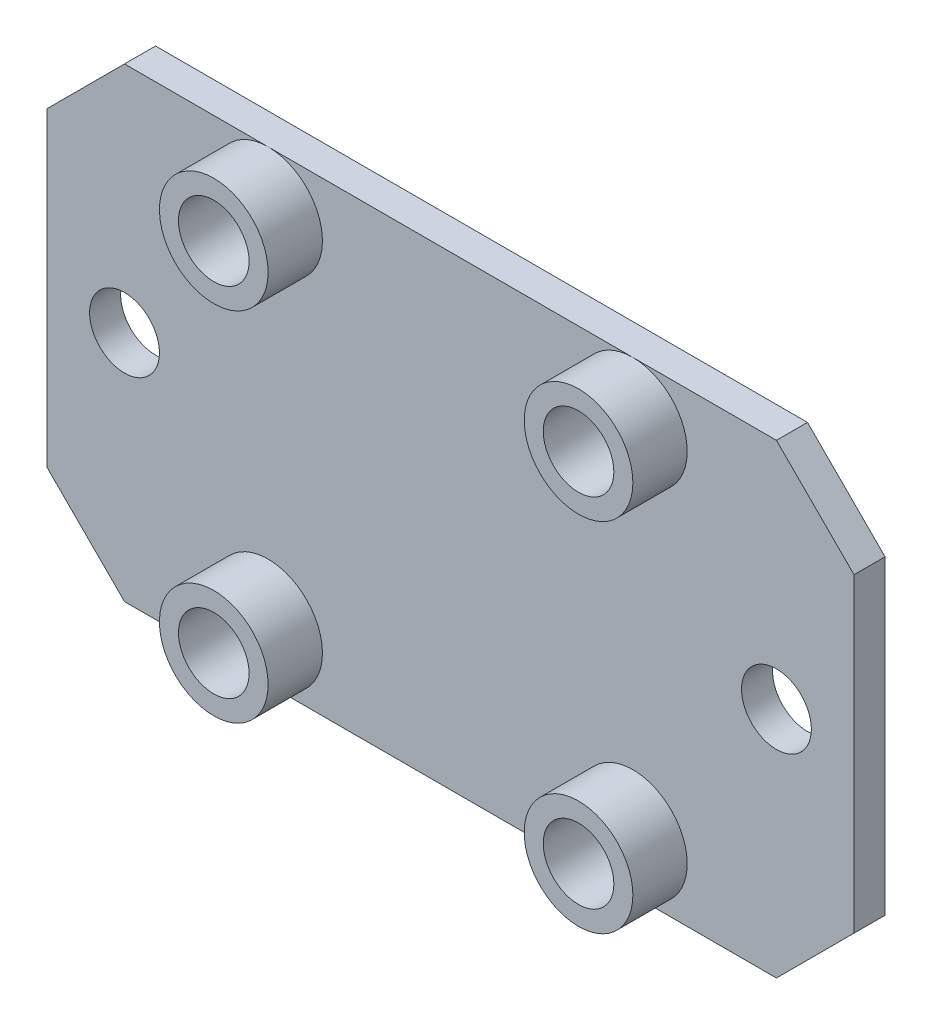
ISO-10303-21;
HEADER;
FILE_DESCRIPTION(('STEP AP214'),'2;1');
FILE_NAME('part.step','',(''),(''),'','','');
FILE_SCHEMA(('AUTOMOTIVE_DESIGN { 1 0 10303 214 1 1 1 1 }'));
ENDSEC;
DATA;
#1=APPLICATION_CONTEXT('core data for automotive mechanical design processes');
#2=APPLICATION_PROTOCOL_DEFINITION('international standard','automotive_design',2000,#1);
#3=PRODUCT_CONTEXT('',#1,'mechanical');
#4=PRODUCT('Part','Part','',(#3));
#5=PRODUCT_RELATED_PRODUCT_CATEGORY('part','',(#4));
#6=PRODUCT_DEFINITION_FORMATION('','',#4);
#7=PRODUCT_DEFINITION_CONTEXT('part definition',#1,'design');
#8=PRODUCT_DEFINITION('design','',#6,#7);
#9=PRODUCT_DEFINITION_SHAPE('','',#8);
#10=(LENGTH_UNIT() NAMED_UNIT(*) SI_UNIT(.MILLI.,.METRE.));
#11=(NAMED_UNIT(*) PLANE_ANGLE_UNIT() SI_UNIT($,.RADIAN.));
#12=(NAMED_UNIT(*) SI_UNIT($,.STERADIAN.) SOLID_ANGLE_UNIT());
#13=UNCERTAINTY_MEASURE_WITH_UNIT(LENGTH_MEASURE(1.E-05),#10,'distance_accuracy_value','');
#14=(GEOMETRIC_REPRESENTATION_CONTEXT(3) GLOBAL_UNCERTAINTY_ASSIGNED_CONTEXT((#13)) GLOBAL_UNIT_ASSIGNED_CONTEXT((#10,
#11,#12)) REPRESENTATION_CONTEXT('',''));
#15=CARTESIAN_POINT('',(0.,0.,0.));
#16=DIRECTION('',(0.,0.,1.));
#17=DIRECTION('',(1.,0.,0.));
#18=AXIS2_PLACEMENT_3D('',#15,#16,#17);
#19=CARTESIAN_POINT('',(0.,0.,2.));
#20=DIRECTION('',(0.,1.,0.));
#21=DIRECTION('',(0.,0.,1.));
#22=AXIS2_PLACEMENT_3D('',#19,#20,#21);
#23=PLANE('',#22);
#24=DIRECTION('',(1.,0.,0.));
#25=VECTOR('',#24,1.);
#26=CARTESIAN_POINT('',(0.,0.,2.));
#27=LINE('',#26,#25);
#28=CARTESIAN_POINT('',(-47.,0.,2.));
#29=VERTEX_POINT('',#28);
#30=CARTESIAN_POINT('',(-37.75,0.,2.));
#31=VERTEX_POINT('',#30);
#32=EDGE_CURVE('E136',#29,#31,#27,.T.);
#33=ORIENTED_EDGE('',*,*,#32,.F.);
#34=DIRECTION('',(0.,0.,-1.));
#35=VECTOR('',#34,1.);
#36=CARTESIAN_POINT('',(-47.,0.,2.));
#37=LINE('',#36,#35);
#38=CARTESIAN_POINT('',(-47.,0.,0.));
#39=VERTEX_POINT('',#38);
#40=EDGE_CURVE('E143',#29,#39,#37,.T.);
#41=ORIENTED_EDGE('',*,*,#40,.T.);
#42=DIRECTION('',(1.,0.,0.));
#43=VECTOR('',#42,1.);
#44=CARTESIAN_POINT('',(0.,0.,0.));
#45=LINE('',#44,#43);
#46=CARTESIAN_POINT('',(-5.00000000000002,0.,0.));
#47=VERTEX_POINT('',#46);
#48=EDGE_CURVE('E146',#39,#47,#45,.T.);
#49=ORIENTED_EDGE('',*,*,#48,.T.);
#50=DIRECTION('',(0.,0.,1.));
#51=VECTOR('',#50,1.);
#52=CARTESIAN_POINT('',(-5.00000000000002,0.,2.));
#53=LINE('',#52,#51);
#54=CARTESIAN_POINT('',(-5.00000000000002,0.,2.));
#55=VERTEX_POINT('',#54);
#56=EDGE_CURVE('E140',#47,#55,#53,.T.);
#57=ORIENTED_EDGE('',*,*,#56,.T.);
#58=CARTESIAN_POINT('',(-14.25,0.,2.));
#59=VERTEX_POINT('',#58);
#60=EDGE_CURVE('E157',#59,#55,#27,.T.);
#61=ORIENTED_EDGE('',*,*,#60,.F.);
#62=EDGE_CURVE('E214',#31,#59,#27,.T.);
#63=ORIENTED_EDGE('',*,*,#62,.F.);
#64=EDGE_LOOP('',(#33,#41,#49,#57,#61,#63));
#65=FACE_BOUND('',#64,.T.);
#66=ADVANCED_FACE('F43',(#65),#23,.F.);
#67=CARTESIAN_POINT('',(0.,0.,2.));
#68=DIRECTION('',(-1.,0.,0.));
#69=DIRECTION('',(0.,0.,1.));
#70=AXIS2_PLACEMENT_3D('',#67,#68,#69);
#71=PLANE('',#70);
#72=DIRECTION('',(0.,1.,0.));
#73=VECTOR('',#72,1.);
#74=CARTESIAN_POINT('',(0.,0.,2.));
#75=LINE('',#74,#73);
#76=CARTESIAN_POINT('',(0.,5.,2.));
#77=VERTEX_POINT('',#76);
#78=CARTESIAN_POINT('',(0.,25.,2.));
#79=VERTEX_POINT('',#78);
#80=EDGE_CURVE('E135',#77,#79,#75,.T.);
#81=ORIENTED_EDGE('',*,*,#80,.F.);
#82=DIRECTION('',(0.,0.,-1.));
#83=VECTOR('',#82,1.);
#84=CARTESIAN_POINT('',(0.,5.,2.));
#85=LINE('',#84,#83);
#86=CARTESIAN_POINT('',(0.,5.,0.));
#87=VERTEX_POINT('',#86);
#88=EDGE_CURVE('E183',#77,#87,#85,.T.);
#89=ORIENTED_EDGE('',*,*,#88,.T.);
#90=DIRECTION('',(0.,1.,0.));
#91=VECTOR('',#90,1.);
#92=CARTESIAN_POINT('',(0.,0.,0.));
#93=LINE('',#92,#91);
#94=CARTESIAN_POINT('',(0.,25.,0.));
#95=VERTEX_POINT('',#94);
#96=EDGE_CURVE('E149',#87,#95,#93,.T.);
#97=ORIENTED_EDGE('',*,*,#96,.T.);
#98=DIRECTION('',(0.,0.,1.));
#99=VECTOR('',#98,1.);
#100=CARTESIAN_POINT('',(0.,25.,2.));
#101=LINE('',#100,#99);
#102=EDGE_CURVE('E181',#95,#79,#101,.T.);
#103=ORIENTED_EDGE('',*,*,#102,.T.);
#104=EDGE_LOOP('',(#81,#89,#97,#103));
#105=FACE_BOUND('',#104,.T.);
#106=ADVANCED_FACE('F189',(#105),#71,.F.);
#107=CARTESIAN_POINT('',(0.,30.,2.));
#108=DIRECTION('',(0.,-1.,0.));
#109=DIRECTION('',(1.,0.,0.));
#110=AXIS2_PLACEMENT_3D('',#107,#108,#109);
#111=PLANE('',#110);
#112=DIRECTION('',(-1.,0.,0.));
#113=VECTOR('',#112,1.);
#114=CARTESIAN_POINT('',(0.,30.,2.));
#115=LINE('',#114,#113);
#116=CARTESIAN_POINT('',(-5.00000000000001,30.,2.));
#117=VERTEX_POINT('',#116);
#118=CARTESIAN_POINT('',(-14.25,30.,2.));
#119=VERTEX_POINT('',#118);
#120=EDGE_CURVE('E130',#117,#119,#115,.T.);
#121=ORIENTED_EDGE('',*,*,#120,.F.);
#122=DIRECTION('',(0.,0.,-1.));
#123=VECTOR('',#122,1.);
#124=CARTESIAN_POINT('',(-5.00000000000001,30.,2.));
#125=LINE('',#124,#123);
#126=CARTESIAN_POINT('',(-5.00000000000001,30.,0.));
#127=VERTEX_POINT('',#126);
#128=EDGE_CURVE('E11',#117,#127,#125,.T.);
#129=ORIENTED_EDGE('',*,*,#128,.T.);
#130=DIRECTION('',(-1.,0.,0.));
#131=VECTOR('',#130,1.);
#132=CARTESIAN_POINT('',(0.,30.,0.));
#133=LINE('',#132,#131);
#134=CARTESIAN_POINT('',(-47.,30.,0.));
#135=VERTEX_POINT('',#134);
#136=EDGE_CURVE('E153',#127,#135,#133,.T.);
#137=ORIENTED_EDGE('',*,*,#136,.T.);
#138=DIRECTION('',(0.,0.,1.));
#139=VECTOR('',#138,1.);
#140=CARTESIAN_POINT('',(-47.,30.,2.));
#141=LINE('',#140,#139);
#142=CARTESIAN_POINT('',(-47.,30.,2.));
#143=VERTEX_POINT('',#142);
#144=EDGE_CURVE('E52',#135,#143,#141,.T.);
#145=ORIENTED_EDGE('',*,*,#144,.T.);
#146=CARTESIAN_POINT('',(-37.75,30.,2.));
#147=VERTEX_POINT('',#146);
#148=EDGE_CURVE('E131',#147,#143,#115,.T.);
#149=ORIENTED_EDGE('',*,*,#148,.F.);
#150=EDGE_CURVE('E123',#119,#147,#115,.T.);
#151=ORIENTED_EDGE('',*,*,#150,.F.);
#152=EDGE_LOOP('',(#121,#129,#137,#145,#149,#151));
#153=FACE_BOUND('',#152,.T.);
#154=ADVANCED_FACE('F133',(#153),#111,.F.);
#155=CARTESIAN_POINT('',(-52.,0.,2.));
#156=DIRECTION('',(1.,0.,0.));
#157=DIRECTION('',(0.,0.,-1.));
#158=AXIS2_PLACEMENT_3D('',#155,#156,#157);
#159=PLANE('',#158);
#160=DIRECTION('',(0.,-1.,0.));
#161=VECTOR('',#160,1.);
#162=CARTESIAN_POINT('',(-52.,0.,0.));
#163=LINE('',#162,#161);
#164=CARTESIAN_POINT('',(-52.,25.,0.));
#165=VERTEX_POINT('',#164);
#166=CARTESIAN_POINT('',(-52.,5.00000000000002,0.));
#167=VERTEX_POINT('',#166);
#168=EDGE_CURVE('E155',#165,#167,#163,.T.);
#169=ORIENTED_EDGE('',*,*,#168,.T.);
#170=DIRECTION('',(0.,0.,1.));
#171=VECTOR('',#170,1.);
#172=CARTESIAN_POINT('',(-52.,5.00000000000002,2.));
#173=LINE('',#172,#171);
#174=CARTESIAN_POINT('',(-52.,5.00000000000002,2.));
#175=VERTEX_POINT('',#174);
#176=EDGE_CURVE('E172',#167,#175,#173,.T.);
#177=ORIENTED_EDGE('',*,*,#176,.T.);
#178=DIRECTION('',(0.,-1.,0.));
#179=VECTOR('',#178,1.);
#180=CARTESIAN_POINT('',(-52.,0.,2.));
#181=LINE('',#180,#179);
#182=CARTESIAN_POINT('',(-52.,25.,2.));
#183=VERTEX_POINT('',#182);
#184=EDGE_CURVE('E139',#183,#175,#181,.T.);
#185=ORIENTED_EDGE('',*,*,#184,.F.);
#186=DIRECTION('',(0.,0.,-1.));
#187=VECTOR('',#186,1.);
#188=CARTESIAN_POINT('',(-52.,25.,2.));
#189=LINE('',#188,#187);
#190=EDGE_CURVE('E169',#183,#165,#189,.T.);
#191=ORIENTED_EDGE('',*,*,#190,.T.);
#192=EDGE_LOOP('',(#169,#177,#185,#191));
#193=FACE_BOUND('',#192,.T.);
#194=ADVANCED_FACE('F203',(#193),#159,.F.);
#195=CARTESIAN_POINT('',(0.,0.,2.));
#196=DIRECTION('',(0.,0.,-1.));
#197=DIRECTION('',(-1.,0.,0.));
#198=AXIS2_PLACEMENT_3D('',#195,#196,#197);
#199=PLANE('',#198);
#200=CARTESIAN_POINT('',(-47.,15.,2.));
#201=DIRECTION('',(0.,0.,1.));
#202=DIRECTION('',(1.,0.,0.));
#203=AXIS2_PLACEMENT_3D('',#200,#201,#202);
#204=CIRCLE('',#203,2.24999999999999);
#205=CARTESIAN_POINT('',(-44.75,15.,2.));
#206=VERTEX_POINT('',#205);
#207=EDGE_CURVE('E337',#206,#206,#204,.T.);
#208=ORIENTED_EDGE('',*,*,#207,.F.);
#209=EDGE_LOOP('',(#208));
#210=FACE_BOUND('',#209,.T.);
#211=CARTESIAN_POINT('',(-5.,15.,2.));
#212=DIRECTION('',(0.,0.,1.));
#213=DIRECTION('',(1.,0.,0.));
#214=AXIS2_PLACEMENT_3D('',#211,#212,#213);
#215=CIRCLE('',#214,2.24999999999999);
#216=CARTESIAN_POINT('',(-2.75000000000001,15.,2.));
#217=VERTEX_POINT('',#216);
#218=EDGE_CURVE('E339',#217,#217,#215,.T.);
#219=ORIENTED_EDGE('',*,*,#218,.F.);
#220=EDGE_LOOP('',(#219));
#221=FACE_BOUND('',#220,.T.);
#222=ORIENTED_EDGE('',*,*,#184,.T.);
#223=DIRECTION('',(-0.707106781186546,0.707106781186549,0.));
#224=VECTOR('',#223,1.);
#225=CARTESIAN_POINT('',(-47.,0.,2.));
#226=LINE('',#225,#224);
#227=EDGE_CURVE('E179',#175,#29,#226,.F.);
#228=ORIENTED_EDGE('',*,*,#227,.T.);
#229=ORIENTED_EDGE('',*,*,#32,.T.);
#230=CARTESIAN_POINT('',(-37.75,3.5,2.));
#231=DIRECTION('',(0.,0.,1.));
#232=DIRECTION('',(1.,0.,0.));
#233=AXIS2_PLACEMENT_3D('',#230,#231,#232);
#234=CIRCLE('',#233,3.5);
#235=EDGE_CURVE('E380',#31,#31,#234,.T.);
#236=ORIENTED_EDGE('',*,*,#235,.F.);
#237=ORIENTED_EDGE('',*,*,#62,.T.);
#238=CARTESIAN_POINT('',(-14.25,3.5,2.));
#239=DIRECTION('',(0.,0.,1.));
#240=DIRECTION('',(1.,0.,0.));
#241=AXIS2_PLACEMENT_3D('',#238,#239,#240);
#242=CIRCLE('',#241,3.5);
#243=EDGE_CURVE('E220',#59,#59,#242,.T.);
#244=ORIENTED_EDGE('',*,*,#243,.F.);
#245=ORIENTED_EDGE('',*,*,#60,.T.);
#246=DIRECTION('',(-0.707106781186549,-0.707106781186546,0.));
#247=VECTOR('',#246,1.);
#248=CARTESIAN_POINT('',(0.,5.,2.));
#249=LINE('',#248,#247);
#250=EDGE_CURVE('E177',#55,#77,#249,.F.);
#251=ORIENTED_EDGE('',*,*,#250,.T.);
#252=ORIENTED_EDGE('',*,*,#80,.T.);
#253=DIRECTION('',(0.707106781186547,-0.707106781186549,0.));
#254=VECTOR('',#253,1.);
#255=CARTESIAN_POINT('',(-5.00000000000001,30.,2.));
#256=LINE('',#255,#254);
#257=EDGE_CURVE('E66',#79,#117,#256,.F.);
#258=ORIENTED_EDGE('',*,*,#257,.T.);
#259=ORIENTED_EDGE('',*,*,#120,.T.);
#260=CARTESIAN_POINT('',(-14.25,26.5,2.));
#261=DIRECTION('',(0.,0.,1.));
#262=DIRECTION('',(1.,0.,0.));
#263=AXIS2_PLACEMENT_3D('',#260,#261,#262);
#264=CIRCLE('',#263,3.5);
#265=EDGE_CURVE('E129',#119,#119,#264,.T.);
#266=ORIENTED_EDGE('',*,*,#265,.F.);
#267=ORIENTED_EDGE('',*,*,#150,.T.);
#268=CARTESIAN_POINT('',(-37.75,26.5,2.));
#269=DIRECTION('',(0.,0.,1.));
#270=DIRECTION('',(1.,0.,0.));
#271=AXIS2_PLACEMENT_3D('',#268,#269,#270);
#272=CIRCLE('',#271,3.5);
#273=EDGE_CURVE('E127',#147,#147,#272,.T.);
#274=ORIENTED_EDGE('',*,*,#273,.F.);
#275=ORIENTED_EDGE('',*,*,#148,.T.);
#276=DIRECTION('',(0.707106781186549,0.707106781186546,0.));
#277=VECTOR('',#276,1.);
#278=CARTESIAN_POINT('',(-52.,25.,2.));
#279=LINE('',#278,#277);
#280=EDGE_CURVE('E174',#143,#183,#279,.F.);
#281=ORIENTED_EDGE('',*,*,#280,.T.);
#282=EDGE_LOOP('',(#222,#228,#229,#236,#237,#244,#245,#251,#252,#258,#259,#266,#267,#274,#275,#281));
#283=FACE_BOUND('',#282,.T.);
#284=ADVANCED_FACE('F125',(#210,#221,#283),#199,.F.);
#285=CARTESIAN_POINT('',(0.,0.,0.));
#286=DIRECTION('',(0.,0.,-1.));
#287=DIRECTION('',(-1.,0.,0.));
#288=AXIS2_PLACEMENT_3D('',#285,#286,#287);
#289=PLANE('',#288);
#290=CARTESIAN_POINT('',(-47.,15.,0.));
#291=DIRECTION('',(0.,0.,1.));
#292=DIRECTION('',(1.,0.,0.));
#293=AXIS2_PLACEMENT_3D('',#290,#291,#292);
#294=CIRCLE('',#293,2.25);
#295=CARTESIAN_POINT('',(-44.75,15.,0.));
#296=VERTEX_POINT('',#295);
#297=EDGE_CURVE('E334',#296,#296,#294,.T.);
#298=ORIENTED_EDGE('',*,*,#297,.T.);
#299=EDGE_LOOP('',(#298));
#300=FACE_BOUND('',#299,.T.);
#301=CARTESIAN_POINT('',(-5.,15.,0.));
#302=DIRECTION('',(0.,0.,1.));
#303=DIRECTION('',(1.,0.,0.));
#304=AXIS2_PLACEMENT_3D('',#301,#302,#303);
#305=CIRCLE('',#304,2.25);
#306=CARTESIAN_POINT('',(-2.75,15.,0.));
#307=VERTEX_POINT('',#306);
#308=EDGE_CURVE('E344',#307,#307,#305,.T.);
#309=ORIENTED_EDGE('',*,*,#308,.T.);
#310=EDGE_LOOP('',(#309));
#311=FACE_BOUND('',#310,.T.);
#312=ORIENTED_EDGE('',*,*,#48,.F.);
#313=DIRECTION('',(0.707106781186546,-0.707106781186549,0.));
#314=VECTOR('',#313,1.);
#315=CARTESIAN_POINT('',(-23.5000000000001,-23.5,0.));
#316=LINE('',#315,#314);
#317=EDGE_CURVE('E167',#39,#167,#316,.F.);
#318=ORIENTED_EDGE('',*,*,#317,.T.);
#319=ORIENTED_EDGE('',*,*,#168,.F.);
#320=DIRECTION('',(-0.707106781186549,-0.707106781186546,0.));
#321=VECTOR('',#320,1.);
#322=CARTESIAN_POINT('',(-38.4999999999999,38.5,0.));
#323=LINE('',#322,#321);
#324=EDGE_CURVE('E161',#165,#135,#323,.F.);
#325=ORIENTED_EDGE('',*,*,#324,.T.);
#326=ORIENTED_EDGE('',*,*,#136,.F.);
#327=DIRECTION('',(-0.707106781186547,0.707106781186549,0.));
#328=VECTOR('',#327,1.);
#329=CARTESIAN_POINT('',(12.5,12.5,0.));
#330=LINE('',#329,#328);
#331=EDGE_CURVE('E163',#127,#95,#330,.F.);
#332=ORIENTED_EDGE('',*,*,#331,.T.);
#333=ORIENTED_EDGE('',*,*,#96,.F.);
#334=DIRECTION('',(0.707106781186549,0.707106781186546,0.));
#335=VECTOR('',#334,1.);
#336=CARTESIAN_POINT('',(-2.5,2.50000000000001,0.));
#337=LINE('',#336,#335);
#338=EDGE_CURVE('E165',#87,#47,#337,.F.);
#339=ORIENTED_EDGE('',*,*,#338,.T.);
#340=EDGE_LOOP('',(#312,#318,#319,#325,#326,#332,#333,#339));
#341=FACE_BOUND('',#340,.T.);
#342=ADVANCED_FACE('F195',(#300,#311,#341),#289,.T.);
#343=CARTESIAN_POINT('',(-37.75,26.5,5.5));
#344=DIRECTION('',(0.,0.,-1.));
#345=DIRECTION('',(-1.,0.,0.));
#346=AXIS2_PLACEMENT_3D('',#343,#344,#345);
#347=CYLINDRICAL_SURFACE('',#346,3.5);
#348=CARTESIAN_POINT('',(-37.75,26.5,5.5));
#349=DIRECTION('',(0.,0.,1.));
#350=DIRECTION('',(1.,0.,0.));
#351=AXIS2_PLACEMENT_3D('',#348,#349,#350);
#352=CIRCLE('',#351,3.5);
#353=CARTESIAN_POINT('',(-34.25,26.5,5.5));
#354=VERTEX_POINT('',#353);
#355=EDGE_CURVE('E150',#354,#354,#352,.T.);
#356=ORIENTED_EDGE('',*,*,#355,.F.);
#357=EDGE_LOOP('',(#356));
#358=FACE_BOUND('',#357,.T.);
#359=ORIENTED_EDGE('',*,*,#273,.T.);
#360=EDGE_LOOP('',(#359));
#361=FACE_BOUND('',#360,.T.);
#362=ADVANCED_FACE('F256',(#358,#361),#347,.T.);
#363=CARTESIAN_POINT('',(-37.75,26.5,5.5));
#364=DIRECTION('',(0.,0.,1.));
#365=DIRECTION('',(1.,0.,0.));
#366=AXIS2_PLACEMENT_3D('',#363,#364,#365);
#367=PLANE('',#366);
#368=CARTESIAN_POINT('',(-37.75,26.5,5.5));
#369=DIRECTION('',(0.,0.,1.));
#370=DIRECTION('',(1.,0.,0.));
#371=AXIS2_PLACEMENT_3D('',#368,#369,#370);
#372=CIRCLE('',#371,2.275);
#373=CARTESIAN_POINT('',(-35.475,26.5,5.5));
#374=VERTEX_POINT('',#373);
#375=EDGE_CURVE('E351',#374,#374,#372,.T.);
#376=ORIENTED_EDGE('',*,*,#375,.F.);
#377=EDGE_LOOP('',(#376));
#378=FACE_BOUND('',#377,.T.);
#379=ORIENTED_EDGE('',*,*,#355,.T.);
#380=EDGE_LOOP('',(#379));
#381=FACE_BOUND('',#380,.T.);
#382=ADVANCED_FACE('F263',(#378,#381),#367,.T.);
#383=CARTESIAN_POINT('',(-14.25,26.5,5.5));
#384=DIRECTION('',(0.,0.,-1.));
#385=DIRECTION('',(-1.,0.,0.));
#386=AXIS2_PLACEMENT_3D('',#383,#384,#385);
#387=CYLINDRICAL_SURFACE('',#386,3.5);
#388=CARTESIAN_POINT('',(-14.25,26.5,5.5));
#389=DIRECTION('',(0.,0.,1.));
#390=DIRECTION('',(1.,0.,0.));
#391=AXIS2_PLACEMENT_3D('',#388,#389,#390);
#392=CIRCLE('',#391,3.5);
#393=CARTESIAN_POINT('',(-10.75,26.5,5.5));
#394=VERTEX_POINT('',#393);
#395=EDGE_CURVE('E373',#394,#394,#392,.T.);
#396=ORIENTED_EDGE('',*,*,#395,.F.);
#397=EDGE_LOOP('',(#396));
#398=FACE_BOUND('',#397,.T.);
#399=ORIENTED_EDGE('',*,*,#265,.T.);
#400=EDGE_LOOP('',(#399));
#401=FACE_BOUND('',#400,.T.);
#402=ADVANCED_FACE('F267',(#398,#401),#387,.T.);
#403=CARTESIAN_POINT('',(-14.25,26.5,5.5));
#404=DIRECTION('',(0.,0.,1.));
#405=DIRECTION('',(1.,0.,0.));
#406=AXIS2_PLACEMENT_3D('',#403,#404,#405);
#407=PLANE('',#406);
#408=CARTESIAN_POINT('',(-14.25,26.5,5.5));
#409=DIRECTION('',(0.,0.,1.));
#410=DIRECTION('',(1.,0.,0.));
#411=AXIS2_PLACEMENT_3D('',#408,#409,#410);
#412=CIRCLE('',#411,2.275);
#413=CARTESIAN_POINT('',(-11.975,26.5,5.5));
#414=VERTEX_POINT('',#413);
#415=EDGE_CURVE('E348',#414,#414,#412,.T.);
#416=ORIENTED_EDGE('',*,*,#415,.F.);
#417=EDGE_LOOP('',(#416));
#418=FACE_BOUND('',#417,.T.);
#419=ORIENTED_EDGE('',*,*,#395,.T.);
#420=EDGE_LOOP('',(#419));
#421=FACE_BOUND('',#420,.T.);
#422=ADVANCED_FACE('F285',(#418,#421),#407,.T.);
#423=CARTESIAN_POINT('',(-14.25,3.5,5.5));
#424=DIRECTION('',(0.,0.,-1.));
#425=DIRECTION('',(-1.,0.,0.));
#426=AXIS2_PLACEMENT_3D('',#423,#424,#425);
#427=CYLINDRICAL_SURFACE('',#426,3.5);
#428=CARTESIAN_POINT('',(-14.25,3.5,5.5));
#429=DIRECTION('',(0.,0.,1.));
#430=DIRECTION('',(1.,0.,0.));
#431=AXIS2_PLACEMENT_3D('',#428,#429,#430);
#432=CIRCLE('',#431,3.5);
#433=CARTESIAN_POINT('',(-10.75,3.5,5.5));
#434=VERTEX_POINT('',#433);
#435=EDGE_CURVE('E377',#434,#434,#432,.T.);
#436=ORIENTED_EDGE('',*,*,#435,.F.);
#437=EDGE_LOOP('',(#436));
#438=FACE_BOUND('',#437,.T.);
#439=ORIENTED_EDGE('',*,*,#243,.T.);
#440=EDGE_LOOP('',(#439));
#441=FACE_BOUND('',#440,.T.);
#442=ADVANCED_FACE('F281',(#438,#441),#427,.T.);
#443=CARTESIAN_POINT('',(-14.25,3.5,5.5));
#444=DIRECTION('',(0.,0.,1.));
#445=DIRECTION('',(1.,0.,0.));
#446=AXIS2_PLACEMENT_3D('',#443,#444,#445);
#447=PLANE('',#446);
#448=CARTESIAN_POINT('',(-14.25,3.5,5.5));
#449=DIRECTION('',(0.,0.,1.));
#450=DIRECTION('',(1.,0.,0.));
#451=AXIS2_PLACEMENT_3D('',#448,#449,#450);
#452=CIRCLE('',#451,2.275);
#453=CARTESIAN_POINT('',(-11.975,3.5,5.5));
#454=VERTEX_POINT('',#453);
#455=EDGE_CURVE('E355',#454,#454,#452,.T.);
#456=ORIENTED_EDGE('',*,*,#455,.F.);
#457=EDGE_LOOP('',(#456));
#458=FACE_BOUND('',#457,.T.);
#459=ORIENTED_EDGE('',*,*,#435,.T.);
#460=EDGE_LOOP('',(#459));
#461=FACE_BOUND('',#460,.T.);
#462=ADVANCED_FACE('F277',(#458,#461),#447,.T.);
#463=CARTESIAN_POINT('',(-37.75,3.5,5.5));
#464=DIRECTION('',(0.,0.,-1.));
#465=DIRECTION('',(-1.,0.,0.));
#466=AXIS2_PLACEMENT_3D('',#463,#464,#465);
#467=CYLINDRICAL_SURFACE('',#466,3.5);
#468=CARTESIAN_POINT('',(-37.75,3.5,5.5));
#469=DIRECTION('',(0.,0.,1.));
#470=DIRECTION('',(1.,0.,0.));
#471=AXIS2_PLACEMENT_3D('',#468,#469,#470);
#472=CIRCLE('',#471,3.5);
#473=CARTESIAN_POINT('',(-34.25,3.5,5.5));
#474=VERTEX_POINT('',#473);
#475=EDGE_CURVE('E369',#474,#474,#472,.T.);
#476=ORIENTED_EDGE('',*,*,#475,.F.);
#477=EDGE_LOOP('',(#476));
#478=FACE_BOUND('',#477,.T.);
#479=ORIENTED_EDGE('',*,*,#235,.T.);
#480=EDGE_LOOP('',(#479));
#481=FACE_BOUND('',#480,.T.);
#482=ADVANCED_FACE('F273',(#478,#481),#467,.T.);
#483=CARTESIAN_POINT('',(-37.75,3.5,5.5));
#484=DIRECTION('',(0.,0.,1.));
#485=DIRECTION('',(1.,0.,0.));
#486=AXIS2_PLACEMENT_3D('',#483,#484,#485);
#487=PLANE('',#486);
#488=CARTESIAN_POINT('',(-37.75,3.5,5.5));
#489=DIRECTION('',(0.,0.,1.));
#490=DIRECTION('',(1.,0.,0.));
#491=AXIS2_PLACEMENT_3D('',#488,#489,#490);
#492=CIRCLE('',#491,2.275);
#493=CARTESIAN_POINT('',(-35.475,3.5,5.5));
#494=VERTEX_POINT('',#493);
#495=EDGE_CURVE('E361',#494,#494,#492,.T.);
#496=ORIENTED_EDGE('',*,*,#495,.F.);
#497=EDGE_LOOP('',(#496));
#498=FACE_BOUND('',#497,.T.);
#499=ORIENTED_EDGE('',*,*,#475,.T.);
#500=EDGE_LOOP('',(#499));
#501=FACE_BOUND('',#500,.T.);
#502=ADVANCED_FACE('F269',(#498,#501),#487,.T.);
#503=CARTESIAN_POINT('',(-37.75,3.5,2.));
#504=DIRECTION('',(0.,0.,1.));
#505=DIRECTION('',(1.,0.,0.));
#506=AXIS2_PLACEMENT_3D('',#503,#504,#505);
#507=CYLINDRICAL_SURFACE('',#506,2.275);
#508=CARTESIAN_POINT('',(-37.75,3.5,2.));
#509=DIRECTION('',(0.,0.,1.));
#510=DIRECTION('',(1.,0.,0.));
#511=AXIS2_PLACEMENT_3D('',#508,#509,#510);
#512=CIRCLE('',#511,2.275);
#513=CARTESIAN_POINT('',(-35.475,3.5,2.));
#514=VERTEX_POINT('',#513);
#515=EDGE_CURVE('E347',#514,#514,#512,.T.);
#516=ORIENTED_EDGE('',*,*,#515,.F.);
#517=EDGE_LOOP('',(#516));
#518=FACE_BOUND('',#517,.T.);
#519=ORIENTED_EDGE('',*,*,#495,.T.);
#520=EDGE_LOOP('',(#519));
#521=FACE_BOUND('',#520,.T.);
#522=ADVANCED_FACE('F272',(#518,#521),#507,.F.);
#523=CARTESIAN_POINT('',(-37.75,3.5,2.));
#524=DIRECTION('',(0.,0.,1.));
#525=DIRECTION('',(1.,0.,0.));
#526=AXIS2_PLACEMENT_3D('',#523,#524,#525);
#527=PLANE('',#526);
#528=ORIENTED_EDGE('',*,*,#515,.T.);
#529=EDGE_LOOP('',(#528));
#530=FACE_BOUND('',#529,.T.);
#531=ADVANCED_FACE('F303',(#530),#527,.T.);
#532=CARTESIAN_POINT('',(-14.25,3.5,2.));
#533=DIRECTION('',(0.,0.,1.));
#534=DIRECTION('',(1.,0.,0.));
#535=AXIS2_PLACEMENT_3D('',#532,#533,#534);
#536=CYLINDRICAL_SURFACE('',#535,2.275);
#537=CARTESIAN_POINT('',(-14.25,3.5,2.));
#538=DIRECTION('',(0.,0.,1.));
#539=DIRECTION('',(1.,0.,0.));
#540=AXIS2_PLACEMENT_3D('',#537,#538,#539);
#541=CIRCLE('',#540,2.275);
#542=CARTESIAN_POINT('',(-11.975,3.5,2.));
#543=VERTEX_POINT('',#542);
#544=EDGE_CURVE('E358',#543,#543,#541,.T.);
#545=ORIENTED_EDGE('',*,*,#544,.F.);
#546=EDGE_LOOP('',(#545));
#547=FACE_BOUND('',#546,.T.);
#548=ORIENTED_EDGE('',*,*,#455,.T.);
#549=EDGE_LOOP('',(#548));
#550=FACE_BOUND('',#549,.T.);
#551=ADVANCED_FACE('F306',(#547,#550),#536,.F.);
#552=CARTESIAN_POINT('',(-14.25,3.5,2.));
#553=DIRECTION('',(0.,0.,1.));
#554=DIRECTION('',(1.,0.,0.));
#555=AXIS2_PLACEMENT_3D('',#552,#553,#554);
#556=PLANE('',#555);
#557=ORIENTED_EDGE('',*,*,#544,.T.);
#558=EDGE_LOOP('',(#557));
#559=FACE_BOUND('',#558,.T.);
#560=ADVANCED_FACE('F311',(#559),#556,.T.);
#561=CARTESIAN_POINT('',(-14.25,26.5,2.));
#562=DIRECTION('',(0.,0.,1.));
#563=DIRECTION('',(1.,0.,0.));
#564=AXIS2_PLACEMENT_3D('',#561,#562,#563);
#565=CYLINDRICAL_SURFACE('',#564,2.275);
#566=CARTESIAN_POINT('',(-14.25,26.5,2.));
#567=DIRECTION('',(0.,0.,1.));
#568=DIRECTION('',(1.,0.,0.));
#569=AXIS2_PLACEMENT_3D('',#566,#567,#568);
#570=CIRCLE('',#569,2.275);
#571=CARTESIAN_POINT('',(-11.975,26.5,2.));
#572=VERTEX_POINT('',#571);
#573=EDGE_CURVE('E352',#572,#572,#570,.T.);
#574=ORIENTED_EDGE('',*,*,#573,.F.);
#575=EDGE_LOOP('',(#574));
#576=FACE_BOUND('',#575,.T.);
#577=ORIENTED_EDGE('',*,*,#415,.T.);
#578=EDGE_LOOP('',(#577));
#579=FACE_BOUND('',#578,.T.);
#580=ADVANCED_FACE('F314',(#576,#579),#565,.F.);
#581=CARTESIAN_POINT('',(-14.25,26.5,2.));
#582=DIRECTION('',(0.,0.,1.));
#583=DIRECTION('',(1.,0.,0.));
#584=AXIS2_PLACEMENT_3D('',#581,#582,#583);
#585=PLANE('',#584);
#586=ORIENTED_EDGE('',*,*,#573,.T.);
#587=EDGE_LOOP('',(#586));
#588=FACE_BOUND('',#587,.T.);
#589=ADVANCED_FACE('F297',(#588),#585,.T.);
#590=CARTESIAN_POINT('',(-37.75,26.5,2.));
#591=DIRECTION('',(0.,0.,1.));
#592=DIRECTION('',(1.,0.,0.));
#593=AXIS2_PLACEMENT_3D('',#590,#591,#592);
#594=CYLINDRICAL_SURFACE('',#593,2.275);
#595=CARTESIAN_POINT('',(-37.75,26.5,2.));
#596=DIRECTION('',(0.,0.,1.));
#597=DIRECTION('',(1.,0.,0.));
#598=AXIS2_PLACEMENT_3D('',#595,#596,#597);
#599=CIRCLE('',#598,2.275);
#600=CARTESIAN_POINT('',(-35.475,26.5,2.));
#601=VERTEX_POINT('',#600);
#602=EDGE_CURVE('E366',#601,#601,#599,.T.);
#603=ORIENTED_EDGE('',*,*,#602,.F.);
#604=EDGE_LOOP('',(#603));
#605=FACE_BOUND('',#604,.T.);
#606=ORIENTED_EDGE('',*,*,#375,.T.);
#607=EDGE_LOOP('',(#606));
#608=FACE_BOUND('',#607,.T.);
#609=ADVANCED_FACE('F293',(#605,#608),#594,.F.);
#610=CARTESIAN_POINT('',(-37.75,26.5,2.));
#611=DIRECTION('',(0.,0.,1.));
#612=DIRECTION('',(1.,0.,0.));
#613=AXIS2_PLACEMENT_3D('',#610,#611,#612);
#614=PLANE('',#613);
#615=ORIENTED_EDGE('',*,*,#602,.T.);
#616=EDGE_LOOP('',(#615));
#617=FACE_BOUND('',#616,.T.);
#618=ADVANCED_FACE('F296',(#617),#614,.T.);
#619=CARTESIAN_POINT('',(-5.,15.,2.));
#620=DIRECTION('',(0.,0.,1.));
#621=DIRECTION('',(1.,0.,0.));
#622=AXIS2_PLACEMENT_3D('',#619,#620,#621);
#623=CYLINDRICAL_SURFACE('',#622,2.24999999999999);
#624=ORIENTED_EDGE('',*,*,#308,.F.);
#625=EDGE_LOOP('',(#624));
#626=FACE_BOUND('',#625,.T.);
#627=ORIENTED_EDGE('',*,*,#218,.T.);
#628=EDGE_LOOP('',(#627));
#629=FACE_BOUND('',#628,.T.);
#630=ADVANCED_FACE('F301',(#626,#629),#623,.F.);
#631=CARTESIAN_POINT('',(-47.,15.,2.));
#632=DIRECTION('',(0.,0.,1.));
#633=DIRECTION('',(1.,0.,0.));
#634=AXIS2_PLACEMENT_3D('',#631,#632,#633);
#635=CYLINDRICAL_SURFACE('',#634,2.25);
#636=ORIENTED_EDGE('',*,*,#297,.F.);
#637=EDGE_LOOP('',(#636));
#638=FACE_BOUND('',#637,.T.);
#639=ORIENTED_EDGE('',*,*,#207,.T.);
#640=EDGE_LOOP('',(#639));
#641=FACE_BOUND('',#640,.T.);
#642=ADVANCED_FACE('F229',(#638,#641),#635,.F.);
#643=CARTESIAN_POINT('',(-47.,0.,2.));
#644=DIRECTION('',(0.707106781186549,0.707106781186546,0.));
#645=DIRECTION('',(0.,0.,-1.));
#646=AXIS2_PLACEMENT_3D('',#643,#644,#645);
#647=PLANE('',#646);
#648=ORIENTED_EDGE('',*,*,#227,.F.);
#649=ORIENTED_EDGE('',*,*,#176,.F.);
#650=ORIENTED_EDGE('',*,*,#317,.F.);
#651=ORIENTED_EDGE('',*,*,#40,.F.);
#652=EDGE_LOOP('',(#648,#649,#650,#651));
#653=FACE_BOUND('',#652,.T.);
#654=ADVANCED_FACE('F207',(#653),#647,.F.);
#655=CARTESIAN_POINT('',(0.,5.,2.));
#656=DIRECTION('',(-0.707106781186546,0.707106781186549,0.));
#657=DIRECTION('',(0.,0.,-1.));
#658=AXIS2_PLACEMENT_3D('',#655,#656,#657);
#659=PLANE('',#658);
#660=ORIENTED_EDGE('',*,*,#250,.F.);
#661=ORIENTED_EDGE('',*,*,#56,.F.);
#662=ORIENTED_EDGE('',*,*,#338,.F.);
#663=ORIENTED_EDGE('',*,*,#88,.F.);
#664=EDGE_LOOP('',(#660,#661,#662,#663));
#665=FACE_BOUND('',#664,.T.);
#666=ADVANCED_FACE('F222',(#665),#659,.F.);
#667=CARTESIAN_POINT('',(-5.00000000000001,30.,2.));
#668=DIRECTION('',(-0.707106781186549,-0.707106781186547,0.));
#669=DIRECTION('',(0.,0.,-1.));
#670=AXIS2_PLACEMENT_3D('',#667,#668,#669);
#671=PLANE('',#670);
#672=ORIENTED_EDGE('',*,*,#257,.F.);
#673=ORIENTED_EDGE('',*,*,#102,.F.);
#674=ORIENTED_EDGE('',*,*,#331,.F.);
#675=ORIENTED_EDGE('',*,*,#128,.F.);
#676=EDGE_LOOP('',(#672,#673,#674,#675));
#677=FACE_BOUND('',#676,.T.);
#678=ADVANCED_FACE('F199',(#677),#671,.F.);
#679=CARTESIAN_POINT('',(-52.,25.,2.));
#680=DIRECTION('',(0.707106781186546,-0.707106781186549,0.));
#681=DIRECTION('',(0.,0.,-1.));
#682=AXIS2_PLACEMENT_3D('',#679,#680,#681);
#683=PLANE('',#682);
#684=ORIENTED_EDGE('',*,*,#280,.F.);
#685=ORIENTED_EDGE('',*,*,#144,.F.);
#686=ORIENTED_EDGE('',*,*,#324,.F.);
#687=ORIENTED_EDGE('',*,*,#190,.F.);
#688=EDGE_LOOP('',(#684,#685,#686,#687));
#689=FACE_BOUND('',#688,.T.);
#690=ADVANCED_FACE('F46',(#689),#683,.F.);
#691=CLOSED_SHELL('',(#66,#106,#154,#194,#284,#342,#362,#382,#402,#422,#442,#462,#482,#502,#522,
#531,#551,#560,#580,#589,#609,#618,#630,#642,#654,#666,#678,#690));
#692=MANIFOLD_SOLID_BREP('B2',#691);
#693=ADVANCED_BREP_SHAPE_REPRESENTATION('',(#18,#692),#14);
#694=SHAPE_DEFINITION_REPRESENTATION(#9,#693);
ENDSEC;
END-ISO-10303-21;
